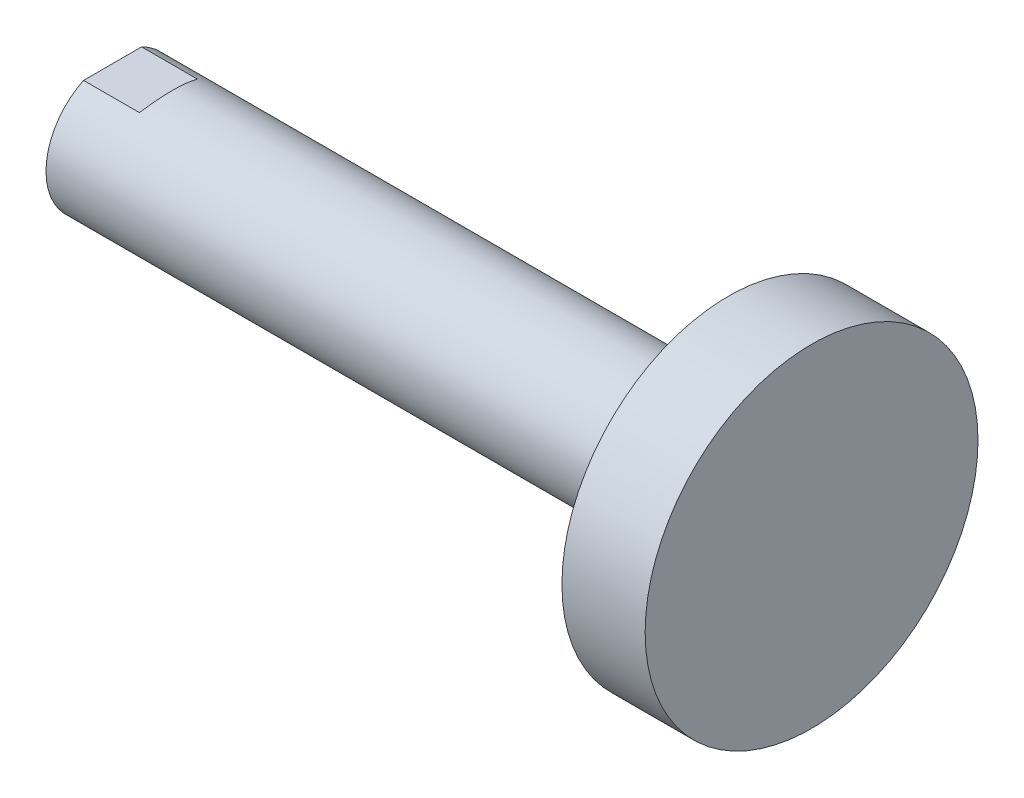
ISO-10303-21;
HEADER;
FILE_DESCRIPTION(('STEP AP214'),'2;1');
FILE_NAME('part.step','',(''),(''),'','','');
FILE_SCHEMA(('AUTOMOTIVE_DESIGN { 1 0 10303 214 1 1 1 1 }'));
ENDSEC;
DATA;
#1=APPLICATION_CONTEXT('core data for automotive mechanical design processes');
#2=APPLICATION_PROTOCOL_DEFINITION('international standard','automotive_design',2000,#1);
#3=PRODUCT_CONTEXT('',#1,'mechanical');
#4=PRODUCT('Part','Part','',(#3));
#5=PRODUCT_RELATED_PRODUCT_CATEGORY('part','',(#4));
#6=PRODUCT_DEFINITION_FORMATION('','',#4);
#7=PRODUCT_DEFINITION_CONTEXT('part definition',#1,'design');
#8=PRODUCT_DEFINITION('design','',#6,#7);
#9=PRODUCT_DEFINITION_SHAPE('','',#8);
#10=(LENGTH_UNIT() NAMED_UNIT(*) SI_UNIT(.MILLI.,.METRE.));
#11=(NAMED_UNIT(*) PLANE_ANGLE_UNIT() SI_UNIT($,.RADIAN.));
#12=(NAMED_UNIT(*) SI_UNIT($,.STERADIAN.) SOLID_ANGLE_UNIT());
#13=UNCERTAINTY_MEASURE_WITH_UNIT(LENGTH_MEASURE(1.E-05),#10,'distance_accuracy_value','');
#14=(GEOMETRIC_REPRESENTATION_CONTEXT(3) GLOBAL_UNCERTAINTY_ASSIGNED_CONTEXT((#13)) GLOBAL_UNIT_ASSIGNED_CONTEXT((#10,
#11,#12)) REPRESENTATION_CONTEXT('',''));
#15=CARTESIAN_POINT('',(0.,0.,0.));
#16=DIRECTION('',(0.,0.,1.));
#17=DIRECTION('',(1.,0.,0.));
#18=AXIS2_PLACEMENT_3D('',#15,#16,#17);
#19=CARTESIAN_POINT('',(-5.5,0.,0.));
#20=DIRECTION('',(1.,0.,0.));
#21=DIRECTION('',(0.,0.,-1.));
#22=AXIS2_PLACEMENT_3D('',#19,#20,#21);
#23=PLANE('',#22);
#24=CARTESIAN_POINT('',(-5.5,0.,0.));
#25=DIRECTION('',(-1.,0.,0.));
#26=DIRECTION('',(0.,0.,1.));
#27=AXIS2_PLACEMENT_3D('',#24,#25,#26);
#28=CIRCLE('',#27,5.);
#29=CARTESIAN_POINT('',(-5.5,-4.5,2.17944947177034));
#30=VERTEX_POINT('',#29);
#31=CARTESIAN_POINT('',(-5.5,4.5,2.17944947177034));
#32=VERTEX_POINT('',#31);
#33=EDGE_CURVE('E105',#30,#32,#28,.T.);
#34=ORIENTED_EDGE('',*,*,#33,.T.);
#35=DIRECTION('',(0.,0.,-1.));
#36=VECTOR('',#35,1.);
#37=CARTESIAN_POINT('',(-5.5,4.5,0.));
#38=LINE('',#37,#36);
#39=CARTESIAN_POINT('',(-5.5,4.5,-2.17944947177034));
#40=VERTEX_POINT('',#39);
#41=EDGE_CURVE('E143',#32,#40,#38,.T.);
#42=ORIENTED_EDGE('',*,*,#41,.T.);
#43=CARTESIAN_POINT('',(-5.5,-4.5,-2.17944947177034));
#44=VERTEX_POINT('',#43);
#45=EDGE_CURVE('E137',#40,#44,#28,.T.);
#46=ORIENTED_EDGE('',*,*,#45,.T.);
#47=DIRECTION('',(0.,0.,1.));
#48=VECTOR('',#47,1.);
#49=CARTESIAN_POINT('',(-5.5,-4.5,0.));
#50=LINE('',#49,#48);
#51=EDGE_CURVE('E141',#44,#30,#50,.T.);
#52=ORIENTED_EDGE('',*,*,#51,.T.);
#53=EDGE_LOOP('',(#34,#42,#46,#52));
#54=FACE_BOUND('',#53,.T.);
#55=CARTESIAN_POINT('',(-5.5,0.,0.));
#56=DIRECTION('',(-1.,0.,0.));
#57=DIRECTION('',(0.,0.,1.));
#58=AXIS2_PLACEMENT_3D('',#55,#56,#57);
#59=CIRCLE('',#58,3.6);
#60=CARTESIAN_POINT('',(-5.5,0.,3.6));
#61=VERTEX_POINT('',#60);
#62=EDGE_CURVE('E108',#61,#61,#59,.T.);
#63=ORIENTED_EDGE('',*,*,#62,.F.);
#64=EDGE_LOOP('',(#63));
#65=FACE_BOUND('',#64,.T.);
#66=ADVANCED_FACE('F39',(#54,#65),#23,.F.);
#67=CARTESIAN_POINT('',(47.,0.,0.));
#68=DIRECTION('',(-1.,0.,0.));
#69=DIRECTION('',(0.,0.,1.));
#70=AXIS2_PLACEMENT_3D('',#67,#68,#69);
#71=CYLINDRICAL_SURFACE('',#70,5.);
#72=CARTESIAN_POINT('',(-3.89807621135334,0.,0.));
#73=DIRECTION('',(0.866025403784437,-0.500000000000003,0.));
#74=DIRECTION('',(-0.500000000000003,-0.866025403784437,0.));
#75=AXIS2_PLACEMENT_3D('',#72,#73,#74);
#76=ELLIPSE('',#75,5.77350269189627,5.);
#77=CARTESIAN_POINT('',(-1.3,4.5,-2.17944947177034));
#78=VERTEX_POINT('',#77);
#79=CARTESIAN_POINT('',(-1.3,4.5,2.17944947177034));
#80=VERTEX_POINT('',#79);
#81=EDGE_CURVE('E11',#78,#80,#76,.T.);
#82=ORIENTED_EDGE('',*,*,#81,.T.);
#83=DIRECTION('',(-1.,0.,0.));
#84=VECTOR('',#83,1.);
#85=CARTESIAN_POINT('',(47.,4.5,2.17944947177034));
#86=LINE('',#85,#84);
#87=EDGE_CURVE('E127',#80,#32,#86,.T.);
#88=ORIENTED_EDGE('',*,*,#87,.T.);
#89=ORIENTED_EDGE('',*,*,#33,.F.);
#90=DIRECTION('',(-1.,0.,0.));
#91=VECTOR('',#90,1.);
#92=CARTESIAN_POINT('',(47.,-4.5,2.17944947177034));
#93=LINE('',#92,#91);
#94=CARTESIAN_POINT('',(-1.3,-4.5,2.17944947177033));
#95=VERTEX_POINT('',#94);
#96=EDGE_CURVE('E53',#30,#95,#93,.F.);
#97=ORIENTED_EDGE('',*,*,#96,.T.);
#98=CARTESIAN_POINT('',(-3.89807621135334,0.,0.));
#99=DIRECTION('',(0.866025403784437,0.500000000000003,0.));
#100=DIRECTION('',(-0.500000000000003,0.866025403784437,0.));
#101=AXIS2_PLACEMENT_3D('',#98,#99,#100);
#102=ELLIPSE('',#101,5.77350269189627,5.);
#103=CARTESIAN_POINT('',(-1.3,-4.5,-2.17944947177033));
#104=VERTEX_POINT('',#103);
#105=EDGE_CURVE('E46',#95,#104,#102,.T.);
#106=ORIENTED_EDGE('',*,*,#105,.T.);
#107=DIRECTION('',(-1.,0.,0.));
#108=VECTOR('',#107,1.);
#109=CARTESIAN_POINT('',(47.,-4.5,-2.17944947177034));
#110=LINE('',#109,#108);
#111=EDGE_CURVE('E123',#104,#44,#110,.T.);
#112=ORIENTED_EDGE('',*,*,#111,.T.);
#113=ORIENTED_EDGE('',*,*,#45,.F.);
#114=DIRECTION('',(-1.,0.,0.));
#115=VECTOR('',#114,1.);
#116=CARTESIAN_POINT('',(47.,4.5,-2.17944947177034));
#117=LINE('',#116,#115);
#118=EDGE_CURVE('E61',#40,#78,#117,.F.);
#119=ORIENTED_EDGE('',*,*,#118,.T.);
#120=EDGE_LOOP('',(#82,#88,#89,#97,#106,#112,#113,#119));
#121=FACE_BOUND('',#120,.T.);
#122=CARTESIAN_POINT('',(40.75,0.,0.));
#123=DIRECTION('',(1.,0.,0.));
#124=DIRECTION('',(0.,0.,-1.));
#125=AXIS2_PLACEMENT_3D('',#122,#123,#124);
#126=CIRCLE('',#125,5.);
#127=CARTESIAN_POINT('',(40.75,0.,-5.));
#128=VERTEX_POINT('',#127);
#129=EDGE_CURVE('E138',#128,#128,#126,.T.);
#130=ORIENTED_EDGE('',*,*,#129,.F.);
#131=EDGE_LOOP('',(#130));
#132=FACE_BOUND('',#131,.T.);
#133=ADVANCED_FACE('F95',(#121,#132),#71,.T.);
#134=CARTESIAN_POINT('',(40.75,0.,0.));
#135=DIRECTION('',(1.,0.,0.));
#136=DIRECTION('',(0.,0.,-1.));
#137=AXIS2_PLACEMENT_3D('',#134,#135,#136);
#138=PLANE('',#137);
#139=CARTESIAN_POINT('',(40.75,0.,0.));
#140=DIRECTION('',(-1.,0.,0.));
#141=DIRECTION('',(0.,0.,1.));
#142=AXIS2_PLACEMENT_3D('',#139,#140,#141);
#143=CIRCLE('',#142,12.5);
#144=CARTESIAN_POINT('',(40.75,0.,12.5));
#145=VERTEX_POINT('',#144);
#146=EDGE_CURVE('E133',#145,#145,#143,.T.);
#147=ORIENTED_EDGE('',*,*,#146,.T.);
#148=EDGE_LOOP('',(#147));
#149=FACE_BOUND('',#148,.T.);
#150=ORIENTED_EDGE('',*,*,#129,.T.);
#151=EDGE_LOOP('',(#150));
#152=FACE_BOUND('',#151,.T.);
#153=ADVANCED_FACE('F100',(#149,#152),#138,.F.);
#154=CARTESIAN_POINT('',(47.,0.,0.));
#155=DIRECTION('',(-1.,0.,0.));
#156=DIRECTION('',(0.,0.,1.));
#157=AXIS2_PLACEMENT_3D('',#154,#155,#156);
#158=CYLINDRICAL_SURFACE('',#157,12.5);
#159=ORIENTED_EDGE('',*,*,#146,.F.);
#160=EDGE_LOOP('',(#159));
#161=FACE_BOUND('',#160,.T.);
#162=CARTESIAN_POINT('',(47.,0.,0.));
#163=DIRECTION('',(-1.,0.,0.));
#164=DIRECTION('',(0.,0.,1.));
#165=AXIS2_PLACEMENT_3D('',#162,#163,#164);
#166=CIRCLE('',#165,12.5);
#167=CARTESIAN_POINT('',(47.,0.,12.5));
#168=VERTEX_POINT('',#167);
#169=EDGE_CURVE('E130',#168,#168,#166,.T.);
#170=ORIENTED_EDGE('',*,*,#169,.T.);
#171=EDGE_LOOP('',(#170));
#172=FACE_BOUND('',#171,.T.);
#173=ADVANCED_FACE('F170',(#161,#172),#158,.T.);
#174=CARTESIAN_POINT('',(47.,5.,0.));
#175=DIRECTION('',(-1.,0.,0.));
#176=DIRECTION('',(0.,0.,1.));
#177=AXIS2_PLACEMENT_3D('',#174,#175,#176);
#178=PLANE('',#177);
#179=ORIENTED_EDGE('',*,*,#169,.F.);
#180=EDGE_LOOP('',(#179));
#181=FACE_BOUND('',#180,.T.);
#182=ADVANCED_FACE('F168',(#181),#178,.F.);
#183=CARTESIAN_POINT('',(-1.3,-4.5,-10.));
#184=DIRECTION('',(0.,1.,0.));
#185=DIRECTION('',(0.,0.,1.));
#186=AXIS2_PLACEMENT_3D('',#183,#184,#185);
#187=PLANE('',#186);
#188=DIRECTION('',(0.,0.,1.));
#189=VECTOR('',#188,1.);
#190=CARTESIAN_POINT('',(-1.3,-4.5,-10.));
#191=LINE('',#190,#189);
#192=EDGE_CURVE('E110',#104,#95,#191,.T.);
#193=ORIENTED_EDGE('',*,*,#192,.T.);
#194=ORIENTED_EDGE('',*,*,#96,.F.);
#195=ORIENTED_EDGE('',*,*,#51,.F.);
#196=ORIENTED_EDGE('',*,*,#111,.F.);
#197=EDGE_LOOP('',(#193,#194,#195,#196));
#198=FACE_BOUND('',#197,.T.);
#199=ADVANCED_FACE('F151',(#198),#187,.F.);
#200=CARTESIAN_POINT('',(4.4735026918963,-14.5,-10.));
#201=DIRECTION('',(0.866025403784437,0.500000000000003,0.));
#202=DIRECTION('',(-0.500000000000003,0.866025403784437,0.));
#203=AXIS2_PLACEMENT_3D('',#200,#201,#202);
#204=PLANE('',#203);
#205=ORIENTED_EDGE('',*,*,#192,.F.);
#206=ORIENTED_EDGE('',*,*,#105,.F.);
#207=EDGE_LOOP('',(#205,#206));
#208=FACE_BOUND('',#207,.T.);
#209=ADVANCED_FACE('F150',(#208),#204,.F.);
#210=CARTESIAN_POINT('',(-1.3,4.5,-10.));
#211=DIRECTION('',(0.866025403784437,-0.500000000000003,0.));
#212=DIRECTION('',(0.500000000000003,0.866025403784437,0.));
#213=AXIS2_PLACEMENT_3D('',#210,#211,#212);
#214=PLANE('',#213);
#215=DIRECTION('',(0.,0.,1.));
#216=VECTOR('',#215,1.);
#217=CARTESIAN_POINT('',(-1.3,4.5,-10.));
#218=LINE('',#217,#216);
#219=EDGE_CURVE('E113',#78,#80,#218,.T.);
#220=ORIENTED_EDGE('',*,*,#219,.T.);
#221=ORIENTED_EDGE('',*,*,#81,.F.);
#222=EDGE_LOOP('',(#220,#221));
#223=FACE_BOUND('',#222,.T.);
#224=ADVANCED_FACE('F154',(#223),#214,.F.);
#225=CARTESIAN_POINT('',(-5.5,4.5,-10.));
#226=DIRECTION('',(0.,-1.,0.));
#227=DIRECTION('',(0.,0.,-1.));
#228=AXIS2_PLACEMENT_3D('',#225,#226,#227);
#229=PLANE('',#228);
#230=ORIENTED_EDGE('',*,*,#219,.F.);
#231=ORIENTED_EDGE('',*,*,#118,.F.);
#232=ORIENTED_EDGE('',*,*,#41,.F.);
#233=ORIENTED_EDGE('',*,*,#87,.F.);
#234=EDGE_LOOP('',(#230,#231,#232,#233));
#235=FACE_BOUND('',#234,.T.);
#236=ADVANCED_FACE('F152',(#235),#229,.F.);
#237=CARTESIAN_POINT('',(-5.1,0.,0.));
#238=DIRECTION('',(-1.,0.,0.));
#239=DIRECTION('',(0.,0.,1.));
#240=AXIS2_PLACEMENT_3D('',#237,#238,#239);
#241=CONICAL_SURFACE('',#240,3.2,0.785398163397447);
#242=ORIENTED_EDGE('',*,*,#62,.T.);
#243=EDGE_LOOP('',(#242));
#244=FACE_BOUND('',#243,.T.);
#245=CARTESIAN_POINT('',(-5.1,0.,0.));
#246=DIRECTION('',(-1.,0.,0.));
#247=DIRECTION('',(0.,0.,1.));
#248=AXIS2_PLACEMENT_3D('',#245,#246,#247);
#249=CIRCLE('',#248,3.2);
#250=CARTESIAN_POINT('',(-5.1,0.,3.2));
#251=VERTEX_POINT('',#250);
#252=EDGE_CURVE('E111',#251,#251,#249,.T.);
#253=ORIENTED_EDGE('',*,*,#252,.F.);
#254=EDGE_LOOP('',(#253));
#255=FACE_BOUND('',#254,.T.);
#256=ADVANCED_FACE('F161',(#244,#255),#241,.F.);
#257=CARTESIAN_POINT('',(13.919415636803,0.,0.));
#258=DIRECTION('',(-1.,0.,0.));
#259=DIRECTION('',(0.,0.,1.));
#260=AXIS2_PLACEMENT_3D('',#257,#258,#259);
#261=CYLINDRICAL_SURFACE('',#260,3.2);
#262=ORIENTED_EDGE('',*,*,#252,.T.);
#263=EDGE_LOOP('',(#262));
#264=FACE_BOUND('',#263,.T.);
#265=CARTESIAN_POINT('',(-2.89999999999977,0.,0.));
#266=DIRECTION('',(-1.,0.,0.));
#267=DIRECTION('',(0.,0.,1.));
#268=AXIS2_PLACEMENT_3D('',#265,#266,#267);
#269=CIRCLE('',#268,3.2);
#270=CARTESIAN_POINT('',(-2.89999999999977,0.,3.2));
#271=VERTEX_POINT('',#270);
#272=EDGE_CURVE('E116',#271,#271,#269,.T.);
#273=ORIENTED_EDGE('',*,*,#272,.F.);
#274=EDGE_LOOP('',(#273));
#275=FACE_BOUND('',#274,.T.);
#276=ADVANCED_FACE('F230',(#264,#275),#261,.F.);
#277=CARTESIAN_POINT('',(-2.89999999999977,3.2,0.));
#278=DIRECTION('',(-1.,0.,0.));
#279=DIRECTION('',(0.,0.,1.));
#280=AXIS2_PLACEMENT_3D('',#277,#278,#279);
#281=PLANE('',#280);
#282=ORIENTED_EDGE('',*,*,#272,.T.);
#283=EDGE_LOOP('',(#282));
#284=FACE_BOUND('',#283,.T.);
#285=CARTESIAN_POINT('',(-2.89999999999977,0.,0.));
#286=DIRECTION('',(-1.,0.,0.));
#287=DIRECTION('',(0.,0.,1.));
#288=AXIS2_PLACEMENT_3D('',#285,#286,#287);
#289=CIRCLE('',#288,3.00000000000013);
#290=CARTESIAN_POINT('',(-2.89999999999977,0.,3.00000000000013));
#291=VERTEX_POINT('',#290);
#292=EDGE_CURVE('E316',#291,#291,#289,.T.);
#293=ORIENTED_EDGE('',*,*,#292,.F.);
#294=EDGE_LOOP('',(#293));
#295=FACE_BOUND('',#294,.T.);
#296=ADVANCED_FACE('F240',(#284,#295),#281,.T.);
#297=CARTESIAN_POINT('',(-2.35849999999977,0.,0.));
#298=DIRECTION('',(-1.,0.,0.));
#299=DIRECTION('',(0.,0.,1.));
#300=AXIS2_PLACEMENT_3D('',#297,#298,#299);
#301=CONICAL_SURFACE('',#300,2.45850000000013,0.785398163397448);
#302=ORIENTED_EDGE('',*,*,#292,.T.);
#303=EDGE_LOOP('',(#302));
#304=FACE_BOUND('',#303,.T.);
#305=CARTESIAN_POINT('',(-2.35849999999977,0.,0.));
#306=DIRECTION('',(-1.,0.,0.));
#307=DIRECTION('',(0.,0.,1.));
#308=AXIS2_PLACEMENT_3D('',#305,#306,#307);
#309=CIRCLE('',#308,2.45850000000013);
#310=CARTESIAN_POINT('',(-2.35849999999977,0.,2.45850000000013));
#311=VERTEX_POINT('',#310);
#312=EDGE_CURVE('E319',#311,#311,#309,.T.);
#313=ORIENTED_EDGE('',*,*,#312,.F.);
#314=EDGE_LOOP('',(#313));
#315=FACE_BOUND('',#314,.T.);
#316=ADVANCED_FACE('F90',(#304,#315),#301,.F.);
#317=CARTESIAN_POINT('',(13.919415636803,0.,0.));
#318=DIRECTION('',(-1.,0.,0.));
#319=DIRECTION('',(0.,0.,1.));
#320=AXIS2_PLACEMENT_3D('',#317,#318,#319);
#321=CYLINDRICAL_SURFACE('',#320,2.45850000000013);
#322=ORIENTED_EDGE('',*,*,#312,.T.);
#323=EDGE_LOOP('',(#322));
#324=FACE_BOUND('',#323,.T.);
#325=CARTESIAN_POINT('',(12.5000000000002,0.,0.));
#326=DIRECTION('',(-1.,0.,0.));
#327=DIRECTION('',(0.,0.,1.));
#328=AXIS2_PLACEMENT_3D('',#325,#326,#327);
#329=CIRCLE('',#328,2.45850000000013);
#330=CARTESIAN_POINT('',(12.5000000000002,0.,2.45850000000013));
#331=VERTEX_POINT('',#330);
#332=EDGE_CURVE('E320',#331,#331,#329,.T.);
#333=ORIENTED_EDGE('',*,*,#332,.F.);
#334=EDGE_LOOP('',(#333));
#335=FACE_BOUND('',#334,.T.);
#336=ADVANCED_FACE('F84',(#324,#335),#321,.F.);
#337=CARTESIAN_POINT('',(13.919415636803,0.,0.));
#338=DIRECTION('',(-1.,0.,0.));
#339=DIRECTION('',(0.,0.,1.));
#340=AXIS2_PLACEMENT_3D('',#337,#338,#339);
#341=CONICAL_SURFACE('',#340,0.,1.0471975511966);
#342=ORIENTED_EDGE('',*,*,#332,.T.);
#343=EDGE_LOOP('',(#342));
#344=FACE_BOUND('',#343,.T.);
#345=CARTESIAN_POINT('',(13.919415636803,0.,0.));
#346=VERTEX_POINT('',#345);
#347=VERTEX_LOOP('',#346);
#348=FACE_BOUND('',#347,.T.);
#349=ADVANCED_FACE('F82',(#344,#348),#341,.F.);
#350=CLOSED_SHELL('',(#66,#133,#153,#173,#182,#199,#209,#224,#236,#256,#276,#296,#316,#336,#349));
#351=MANIFOLD_SOLID_BREP('B2',#350);
#352=ADVANCED_BREP_SHAPE_REPRESENTATION('',(#18,#351),#14);
#353=SHAPE_DEFINITION_REPRESENTATION(#9,#352);
ENDSEC;
END-ISO-10303-21;
